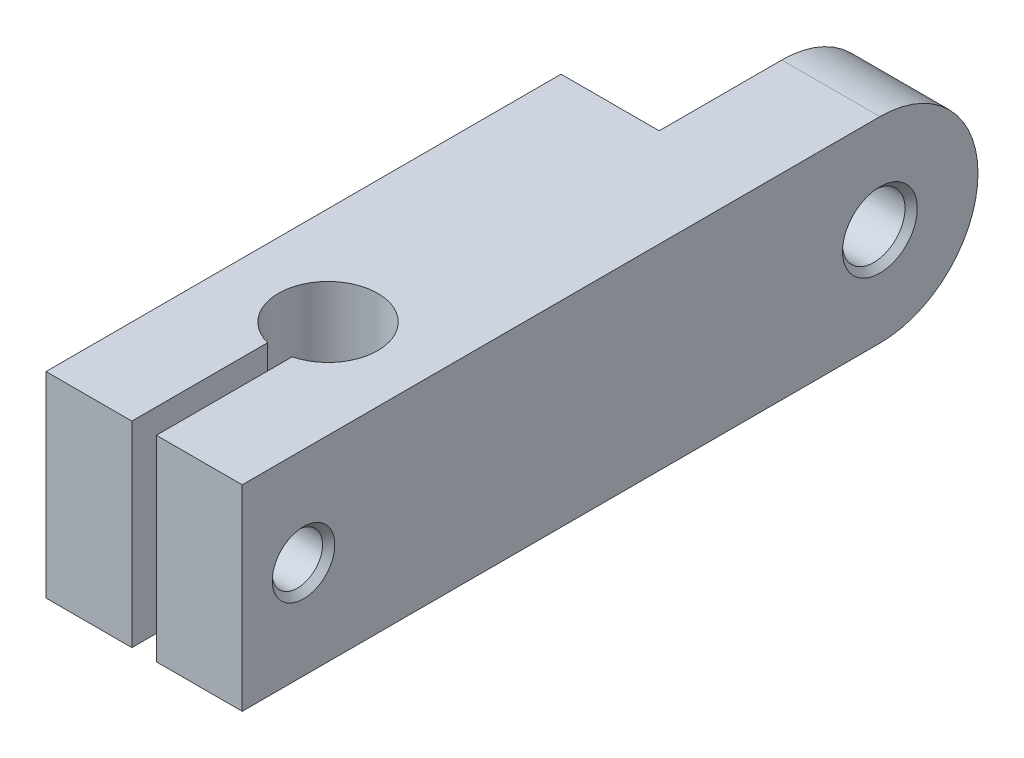
ISO-10303-21;
HEADER;
FILE_DESCRIPTION(('STEP AP214'),'2;1');
FILE_NAME('part.step','',(''),(''),'','','');
FILE_SCHEMA(('AUTOMOTIVE_DESIGN { 1 0 10303 214 1 1 1 1 }'));
ENDSEC;
DATA;
#1=APPLICATION_CONTEXT('core data for automotive mechanical design processes');
#2=APPLICATION_PROTOCOL_DEFINITION('international standard','automotive_design',2000,#1);
#3=PRODUCT_CONTEXT('',#1,'mechanical');
#4=PRODUCT('Part','Part','',(#3));
#5=PRODUCT_RELATED_PRODUCT_CATEGORY('part','',(#4));
#6=PRODUCT_DEFINITION_FORMATION('','',#4);
#7=PRODUCT_DEFINITION_CONTEXT('part definition',#1,'design');
#8=PRODUCT_DEFINITION('design','',#6,#7);
#9=PRODUCT_DEFINITION_SHAPE('','',#8);
#10=(LENGTH_UNIT() NAMED_UNIT(*) SI_UNIT(.MILLI.,.METRE.));
#11=(NAMED_UNIT(*) PLANE_ANGLE_UNIT() SI_UNIT($,.RADIAN.));
#12=(NAMED_UNIT(*) SI_UNIT($,.STERADIAN.) SOLID_ANGLE_UNIT());
#13=UNCERTAINTY_MEASURE_WITH_UNIT(LENGTH_MEASURE(1.E-05),#10,'distance_accuracy_value','');
#14=(GEOMETRIC_REPRESENTATION_CONTEXT(3) GLOBAL_UNCERTAINTY_ASSIGNED_CONTEXT((#13)) GLOBAL_UNIT_ASSIGNED_CONTEXT((#10,
#11,#12)) REPRESENTATION_CONTEXT('',''));
#15=CARTESIAN_POINT('',(0.,0.,0.));
#16=DIRECTION('',(0.,0.,1.));
#17=DIRECTION('',(1.,0.,0.));
#18=AXIS2_PLACEMENT_3D('',#15,#16,#17);
#19=CARTESIAN_POINT('',(8.,8.,60.));
#20=DIRECTION('',(0.,-1.,0.));
#21=DIRECTION('',(1.,0.,0.));
#22=AXIS2_PLACEMENT_3D('',#19,#20,#21);
#23=PLANE('',#22);
#24=DIRECTION('',(-1.,0.,0.));
#25=VECTOR('',#24,1.);
#26=CARTESIAN_POINT('',(8.,8.,8.));
#27=LINE('',#26,#25);
#28=CARTESIAN_POINT('',(8.,8.,8.));
#29=VERTEX_POINT('',#28);
#30=CARTESIAN_POINT('',(0.,8.,8.));
#31=VERTEX_POINT('',#30);
#32=EDGE_CURVE('E123',#29,#31,#27,.T.);
#33=ORIENTED_EDGE('',*,*,#32,.T.);
#34=DIRECTION('',(0.,0.,-1.));
#35=VECTOR('',#34,1.);
#36=CARTESIAN_POINT('',(0.,8.,0.));
#37=LINE('',#36,#35);
#38=CARTESIAN_POINT('',(0.,8.,18.));
#39=VERTEX_POINT('',#38);
#40=EDGE_CURVE('E266',#39,#31,#37,.T.);
#41=ORIENTED_EDGE('',*,*,#40,.F.);
#42=DIRECTION('',(1.,0.,0.));
#43=VECTOR('',#42,1.);
#44=CARTESIAN_POINT('',(-8.,8.,18.));
#45=LINE('',#44,#43);
#46=CARTESIAN_POINT('',(-8.,8.,18.));
#47=VERTEX_POINT('',#46);
#48=EDGE_CURVE('E264',#47,#39,#45,.T.);
#49=ORIENTED_EDGE('',*,*,#48,.F.);
#50=DIRECTION('',(0.,0.,-1.));
#51=VECTOR('',#50,1.);
#52=CARTESIAN_POINT('',(-8.,8.,60.));
#53=LINE('',#52,#51);
#54=CARTESIAN_POINT('',(-8.,8.,60.));
#55=VERTEX_POINT('',#54);
#56=EDGE_CURVE('E147',#55,#47,#53,.T.);
#57=ORIENTED_EDGE('',*,*,#56,.F.);
#58=DIRECTION('',(-1.,0.,0.));
#59=VECTOR('',#58,1.);
#60=CARTESIAN_POINT('',(8.,8.,60.));
#61=LINE('',#60,#59);
#62=CARTESIAN_POINT('',(-0.999999999999996,8.,60.));
#63=VERTEX_POINT('',#62);
#64=EDGE_CURVE('E61',#63,#55,#61,.T.);
#65=ORIENTED_EDGE('',*,*,#64,.F.);
#66=DIRECTION('',(0.,0.,-1.));
#67=VECTOR('',#66,1.);
#68=CARTESIAN_POINT('',(-1.00000000000001,8.,0.));
#69=LINE('',#68,#67);
#70=CARTESIAN_POINT('',(-0.999999999999996,8.,48.9246018906381));
#71=VERTEX_POINT('',#70);
#72=EDGE_CURVE('E54',#63,#71,#69,.T.);
#73=ORIENTED_EDGE('',*,*,#72,.T.);
#74=CARTESIAN_POINT('',(0.,8.,45.));
#75=DIRECTION('',(0.,1.,0.));
#76=DIRECTION('',(-1.,0.,0.));
#77=AXIS2_PLACEMENT_3D('',#74,#75,#76);
#78=CIRCLE('',#77,4.05);
#79=CARTESIAN_POINT('',(1.00000000000001,8.,48.9246018906381));
#80=VERTEX_POINT('',#79);
#81=EDGE_CURVE('E217',#80,#71,#78,.T.);
#82=ORIENTED_EDGE('',*,*,#81,.F.);
#83=DIRECTION('',(0.,0.,-1.));
#84=VECTOR('',#83,1.);
#85=CARTESIAN_POINT('',(1.00000000000001,8.,0.));
#86=LINE('',#85,#84);
#87=CARTESIAN_POINT('',(1.00000000000001,8.,60.));
#88=VERTEX_POINT('',#87);
#89=EDGE_CURVE('E231',#88,#80,#86,.T.);
#90=ORIENTED_EDGE('',*,*,#89,.F.);
#91=CARTESIAN_POINT('',(8.,8.,60.));
#92=VERTEX_POINT('',#91);
#93=EDGE_CURVE('E254',#92,#88,#61,.T.);
#94=ORIENTED_EDGE('',*,*,#93,.F.);
#95=DIRECTION('',(0.,0.,-1.));
#96=VECTOR('',#95,1.);
#97=CARTESIAN_POINT('',(8.,8.,60.));
#98=LINE('',#97,#96);
#99=EDGE_CURVE('E142',#92,#29,#98,.T.);
#100=ORIENTED_EDGE('',*,*,#99,.T.);
#101=EDGE_LOOP('',(#33,#41,#49,#57,#65,#73,#82,#90,#94,#100));
#102=FACE_BOUND('',#101,.T.);
#103=ADVANCED_FACE('F38',(#102),#23,.F.);
#104=CARTESIAN_POINT('',(0.,0.,60.));
#105=DIRECTION('',(0.,0.,1.));
#106=DIRECTION('',(1.,0.,0.));
#107=AXIS2_PLACEMENT_3D('',#104,#105,#106);
#108=PLANE('',#107);
#109=DIRECTION('',(1.,0.,0.));
#110=VECTOR('',#109,1.);
#111=CARTESIAN_POINT('',(8.,-8.,60.));
#112=LINE('',#111,#110);
#113=CARTESIAN_POINT('',(-8.,-8.,60.));
#114=VERTEX_POINT('',#113);
#115=CARTESIAN_POINT('',(-0.999999999999993,-8.,60.));
#116=VERTEX_POINT('',#115);
#117=EDGE_CURVE('E250',#114,#116,#112,.T.);
#118=ORIENTED_EDGE('',*,*,#117,.T.);
#119=DIRECTION('',(0.,1.,0.));
#120=VECTOR('',#119,1.);
#121=CARTESIAN_POINT('',(-0.999999999999993,-8.,60.));
#122=LINE('',#121,#120);
#123=EDGE_CURVE('E245',#116,#63,#122,.T.);
#124=ORIENTED_EDGE('',*,*,#123,.T.);
#125=ORIENTED_EDGE('',*,*,#64,.T.);
#126=DIRECTION('',(0.,-1.,0.));
#127=VECTOR('',#126,1.);
#128=CARTESIAN_POINT('',(-8.,-8.,60.));
#129=LINE('',#128,#127);
#130=EDGE_CURVE('E242',#55,#114,#129,.T.);
#131=ORIENTED_EDGE('',*,*,#130,.T.);
#132=EDGE_LOOP('',(#118,#124,#125,#131));
#133=FACE_BOUND('',#132,.T.);
#134=ADVANCED_FACE('F173',(#133),#108,.T.);
#135=CARTESIAN_POINT('',(-8.,-8.,60.));
#136=DIRECTION('',(1.,0.,0.));
#137=DIRECTION('',(0.,0.,-1.));
#138=AXIS2_PLACEMENT_3D('',#135,#136,#137);
#139=PLANE('',#138);
#140=CARTESIAN_POINT('',(-8.,0.,55.));
#141=DIRECTION('',(-1.,0.,0.));
#142=DIRECTION('',(0.,0.,1.));
#143=AXIS2_PLACEMENT_3D('',#140,#141,#142);
#144=CIRCLE('',#143,1.64999999999999);
#145=CARTESIAN_POINT('',(-8.,0.,56.65));
#146=VERTEX_POINT('',#145);
#147=EDGE_CURVE('E223',#146,#146,#144,.T.);
#148=ORIENTED_EDGE('',*,*,#147,.F.);
#149=EDGE_LOOP('',(#148));
#150=FACE_BOUND('',#149,.T.);
#151=ORIENTED_EDGE('',*,*,#56,.T.);
#152=DIRECTION('',(0.,-1.,0.));
#153=VECTOR('',#152,1.);
#154=CARTESIAN_POINT('',(-8.,0.,18.));
#155=LINE('',#154,#153);
#156=CARTESIAN_POINT('',(-8.,-8.,18.));
#157=VERTEX_POINT('',#156);
#158=EDGE_CURVE('E261',#47,#157,#155,.T.);
#159=ORIENTED_EDGE('',*,*,#158,.T.);
#160=DIRECTION('',(0.,0.,-1.));
#161=VECTOR('',#160,1.);
#162=CARTESIAN_POINT('',(-8.,-8.,60.));
#163=LINE('',#162,#161);
#164=EDGE_CURVE('E141',#114,#157,#163,.T.);
#165=ORIENTED_EDGE('',*,*,#164,.F.);
#166=ORIENTED_EDGE('',*,*,#130,.F.);
#167=EDGE_LOOP('',(#151,#159,#165,#166));
#168=FACE_BOUND('',#167,.T.);
#169=ADVANCED_FACE('F179',(#150,#168),#139,.F.);
#170=CARTESIAN_POINT('',(8.,-8.,60.));
#171=DIRECTION('',(0.,1.,0.));
#172=DIRECTION('',(-1.,0.,0.));
#173=AXIS2_PLACEMENT_3D('',#170,#171,#172);
#174=PLANE('',#173);
#175=DIRECTION('',(0.,0.,-1.));
#176=VECTOR('',#175,1.);
#177=CARTESIAN_POINT('',(0.,-8.,0.));
#178=LINE('',#177,#176);
#179=CARTESIAN_POINT('',(0.,-8.,18.));
#180=VERTEX_POINT('',#179);
#181=CARTESIAN_POINT('',(0.,-8.,8.));
#182=VERTEX_POINT('',#181);
#183=EDGE_CURVE('E137',#180,#182,#178,.T.);
#184=ORIENTED_EDGE('',*,*,#183,.T.);
#185=DIRECTION('',(-1.,0.,0.));
#186=VECTOR('',#185,1.);
#187=CARTESIAN_POINT('',(8.,-8.,8.));
#188=LINE('',#187,#186);
#189=CARTESIAN_POINT('',(8.,-8.,8.));
#190=VERTEX_POINT('',#189);
#191=EDGE_CURVE('E120',#190,#182,#188,.T.);
#192=ORIENTED_EDGE('',*,*,#191,.F.);
#193=DIRECTION('',(0.,0.,-1.));
#194=VECTOR('',#193,1.);
#195=CARTESIAN_POINT('',(8.,-8.,60.));
#196=LINE('',#195,#194);
#197=CARTESIAN_POINT('',(8.,-8.,60.));
#198=VERTEX_POINT('',#197);
#199=EDGE_CURVE('E134',#198,#190,#196,.T.);
#200=ORIENTED_EDGE('',*,*,#199,.F.);
#201=CARTESIAN_POINT('',(1.00000000000001,-8.,60.));
#202=VERTEX_POINT('',#201);
#203=EDGE_CURVE('E249',#202,#198,#112,.T.);
#204=ORIENTED_EDGE('',*,*,#203,.F.);
#205=DIRECTION('',(0.,0.,-1.));
#206=VECTOR('',#205,1.);
#207=CARTESIAN_POINT('',(1.00000000000001,-8.,0.));
#208=LINE('',#207,#206);
#209=CARTESIAN_POINT('',(1.00000000000001,-8.,48.9246018906381));
#210=VERTEX_POINT('',#209);
#211=EDGE_CURVE('E233',#202,#210,#208,.T.);
#212=ORIENTED_EDGE('',*,*,#211,.T.);
#213=CARTESIAN_POINT('',(0.,-8.,45.));
#214=DIRECTION('',(0.,1.,0.));
#215=DIRECTION('',(-1.,0.,0.));
#216=AXIS2_PLACEMENT_3D('',#213,#214,#215);
#217=CIRCLE('',#216,4.05);
#218=CARTESIAN_POINT('',(-0.999999999999994,-8.,48.9246018906381));
#219=VERTEX_POINT('',#218);
#220=EDGE_CURVE('E227',#210,#219,#217,.T.);
#221=ORIENTED_EDGE('',*,*,#220,.T.);
#222=DIRECTION('',(0.,0.,-1.));
#223=VECTOR('',#222,1.);
#224=CARTESIAN_POINT('',(-1.00000000000001,-8.,0.));
#225=LINE('',#224,#223);
#226=EDGE_CURVE('E230',#116,#219,#225,.T.);
#227=ORIENTED_EDGE('',*,*,#226,.F.);
#228=ORIENTED_EDGE('',*,*,#117,.F.);
#229=ORIENTED_EDGE('',*,*,#164,.T.);
#230=DIRECTION('',(1.,0.,0.));
#231=VECTOR('',#230,1.);
#232=CARTESIAN_POINT('',(-8.,-8.,18.));
#233=LINE('',#232,#231);
#234=EDGE_CURVE('E270',#157,#180,#233,.T.);
#235=ORIENTED_EDGE('',*,*,#234,.T.);
#236=EDGE_LOOP('',(#184,#192,#200,#204,#212,#221,#227,#228,#229,#235));
#237=FACE_BOUND('',#236,.T.);
#238=ADVANCED_FACE('F132',(#237),#174,.F.);
#239=CARTESIAN_POINT('',(8.,-8.,60.));
#240=DIRECTION('',(-1.,0.,0.));
#241=DIRECTION('',(0.,0.,1.));
#242=AXIS2_PLACEMENT_3D('',#239,#240,#241);
#243=PLANE('',#242);
#244=CARTESIAN_POINT('',(8.,0.,8.));
#245=DIRECTION('',(-1.,0.,0.));
#246=DIRECTION('',(0.,0.,1.));
#247=AXIS2_PLACEMENT_3D('',#244,#245,#246);
#248=CIRCLE('',#247,3.05);
#249=CARTESIAN_POINT('',(8.,0.,11.05));
#250=VERTEX_POINT('',#249);
#251=EDGE_CURVE('E11',#250,#250,#248,.T.);
#252=ORIENTED_EDGE('',*,*,#251,.T.);
#253=EDGE_LOOP('',(#252));
#254=FACE_BOUND('',#253,.T.);
#255=CARTESIAN_POINT('',(8.,0.,55.));
#256=DIRECTION('',(-1.,0.,0.));
#257=DIRECTION('',(0.,0.,1.));
#258=AXIS2_PLACEMENT_3D('',#255,#256,#257);
#259=CIRCLE('',#258,2.55000000000002);
#260=CARTESIAN_POINT('',(8.,0.,57.55));
#261=VERTEX_POINT('',#260);
#262=EDGE_CURVE('E153',#261,#261,#259,.T.);
#263=ORIENTED_EDGE('',*,*,#262,.T.);
#264=EDGE_LOOP('',(#263));
#265=FACE_BOUND('',#264,.T.);
#266=ORIENTED_EDGE('',*,*,#199,.T.);
#267=CARTESIAN_POINT('',(8.,0.,8.));
#268=DIRECTION('',(1.,0.,0.));
#269=DIRECTION('',(0.,0.,-1.));
#270=AXIS2_PLACEMENT_3D('',#267,#268,#269);
#271=CIRCLE('',#270,8.);
#272=EDGE_CURVE('E117',#190,#29,#271,.T.);
#273=ORIENTED_EDGE('',*,*,#272,.T.);
#274=ORIENTED_EDGE('',*,*,#99,.F.);
#275=DIRECTION('',(0.,1.,0.));
#276=VECTOR('',#275,1.);
#277=CARTESIAN_POINT('',(8.,-8.,60.));
#278=LINE('',#277,#276);
#279=EDGE_CURVE('E140',#198,#92,#278,.T.);
#280=ORIENTED_EDGE('',*,*,#279,.F.);
#281=EDGE_LOOP('',(#266,#273,#274,#280));
#282=FACE_BOUND('',#281,.T.);
#283=ADVANCED_FACE('F139',(#254,#265,#282),#243,.F.);
#284=DIRECTION('',(0.,1.,0.));
#285=VECTOR('',#284,1.);
#286=CARTESIAN_POINT('',(1.00000000000001,-8.,60.));
#287=LINE('',#286,#285);
#288=EDGE_CURVE('E243',#202,#88,#287,.T.);
#289=ORIENTED_EDGE('',*,*,#288,.F.);
#290=ORIENTED_EDGE('',*,*,#203,.T.);
#291=ORIENTED_EDGE('',*,*,#279,.T.);
#292=ORIENTED_EDGE('',*,*,#93,.T.);
#293=EDGE_LOOP('',(#289,#290,#291,#292));
#294=FACE_BOUND('',#293,.T.);
#295=ADVANCED_FACE('F181',(#294),#108,.T.);
#296=CARTESIAN_POINT('',(0.,-8.,45.));
#297=DIRECTION('',(0.,1.,0.));
#298=DIRECTION('',(-1.,0.,0.));
#299=AXIS2_PLACEMENT_3D('',#296,#297,#298);
#300=CYLINDRICAL_SURFACE('',#299,4.05);
#301=ORIENTED_EDGE('',*,*,#81,.T.);
#302=DIRECTION('',(0.,1.,0.));
#303=VECTOR('',#302,1.);
#304=CARTESIAN_POINT('',(-0.999999999999994,-8.,48.9246018906381));
#305=LINE('',#304,#303);
#306=EDGE_CURVE('E235',#219,#71,#305,.T.);
#307=ORIENTED_EDGE('',*,*,#306,.F.);
#308=ORIENTED_EDGE('',*,*,#220,.F.);
#309=DIRECTION('',(0.,1.,0.));
#310=VECTOR('',#309,1.);
#311=CARTESIAN_POINT('',(1.00000000000001,-8.,48.9246018906381));
#312=LINE('',#311,#310);
#313=EDGE_CURVE('E240',#210,#80,#312,.T.);
#314=ORIENTED_EDGE('',*,*,#313,.T.);
#315=EDGE_LOOP('',(#301,#307,#308,#314));
#316=FACE_BOUND('',#315,.T.);
#317=ADVANCED_FACE('F289',(#316),#300,.F.);
#318=CARTESIAN_POINT('',(1.00000000000001,-8.,0.));
#319=DIRECTION('',(1.,0.,0.));
#320=DIRECTION('',(0.,1.,0.));
#321=AXIS2_PLACEMENT_3D('',#318,#319,#320);
#322=PLANE('',#321);
#323=CARTESIAN_POINT('',(1.00000000000001,0.,55.));
#324=DIRECTION('',(1.,0.,0.));
#325=DIRECTION('',(0.,1.,0.));
#326=AXIS2_PLACEMENT_3D('',#323,#324,#325);
#327=CIRCLE('',#326,2.05);
#328=CARTESIAN_POINT('',(1.00000000000001,2.05,55.));
#329=VERTEX_POINT('',#328);
#330=EDGE_CURVE('E215',#329,#329,#327,.F.);
#331=ORIENTED_EDGE('',*,*,#330,.F.);
#332=EDGE_LOOP('',(#331));
#333=FACE_BOUND('',#332,.T.);
#334=ORIENTED_EDGE('',*,*,#89,.T.);
#335=ORIENTED_EDGE('',*,*,#313,.F.);
#336=ORIENTED_EDGE('',*,*,#211,.F.);
#337=ORIENTED_EDGE('',*,*,#288,.T.);
#338=EDGE_LOOP('',(#334,#335,#336,#337));
#339=FACE_BOUND('',#338,.T.);
#340=ADVANCED_FACE('F293',(#333,#339),#322,.F.);
#341=CARTESIAN_POINT('',(-1.00000000000001,-8.,0.));
#342=DIRECTION('',(1.,0.,0.));
#343=DIRECTION('',(0.,0.,-1.));
#344=AXIS2_PLACEMENT_3D('',#341,#342,#343);
#345=PLANE('',#344);
#346=CARTESIAN_POINT('',(-0.999999999999994,0.,55.));
#347=DIRECTION('',(1.,0.,0.));
#348=DIRECTION('',(0.,0.,-1.));
#349=AXIS2_PLACEMENT_3D('',#346,#347,#348);
#350=CIRCLE('',#349,1.64999999999999);
#351=CARTESIAN_POINT('',(-0.999999999999994,0.,53.35));
#352=VERTEX_POINT('',#351);
#353=EDGE_CURVE('E218',#352,#352,#350,.T.);
#354=ORIENTED_EDGE('',*,*,#353,.F.);
#355=EDGE_LOOP('',(#354));
#356=FACE_BOUND('',#355,.T.);
#357=ORIENTED_EDGE('',*,*,#72,.F.);
#358=ORIENTED_EDGE('',*,*,#123,.F.);
#359=ORIENTED_EDGE('',*,*,#226,.T.);
#360=ORIENTED_EDGE('',*,*,#306,.T.);
#361=EDGE_LOOP('',(#357,#358,#359,#360));
#362=FACE_BOUND('',#361,.T.);
#363=ADVANCED_FACE('F206',(#356,#362),#345,.T.);
#364=CARTESIAN_POINT('',(-8.001,0.,55.));
#365=DIRECTION('',(1.,0.,0.));
#366=DIRECTION('',(0.,0.,-1.));
#367=AXIS2_PLACEMENT_3D('',#364,#365,#366);
#368=CYLINDRICAL_SURFACE('',#367,2.05);
#369=CARTESIAN_POINT('',(7.49999999999998,0.,55.));
#370=DIRECTION('',(-1.,0.,0.));
#371=DIRECTION('',(0.,0.,1.));
#372=AXIS2_PLACEMENT_3D('',#369,#370,#371);
#373=CIRCLE('',#372,2.05);
#374=CARTESIAN_POINT('',(7.49999999999998,0.,57.05));
#375=VERTEX_POINT('',#374);
#376=EDGE_CURVE('E145',#375,#375,#373,.F.);
#377=ORIENTED_EDGE('',*,*,#376,.T.);
#378=EDGE_LOOP('',(#377));
#379=FACE_BOUND('',#378,.T.);
#380=ORIENTED_EDGE('',*,*,#330,.T.);
#381=EDGE_LOOP('',(#380));
#382=FACE_BOUND('',#381,.T.);
#383=ADVANCED_FACE('F197',(#379,#382),#368,.F.);
#384=CARTESIAN_POINT('',(7.49999999999998,0.,55.));
#385=DIRECTION('',(1.,0.,0.));
#386=DIRECTION('',(0.,0.,-1.));
#387=AXIS2_PLACEMENT_3D('',#384,#385,#386);
#388=CONICAL_SURFACE('',#387,2.05,0.785398163397447);
#389=ORIENTED_EDGE('',*,*,#262,.F.);
#390=EDGE_LOOP('',(#389));
#391=FACE_BOUND('',#390,.T.);
#392=ORIENTED_EDGE('',*,*,#376,.F.);
#393=EDGE_LOOP('',(#392));
#394=FACE_BOUND('',#393,.T.);
#395=ADVANCED_FACE('F192',(#391,#394),#388,.F.);
#396=CARTESIAN_POINT('',(-8.,0.,55.));
#397=DIRECTION('',(-1.,0.,0.));
#398=DIRECTION('',(0.,0.,1.));
#399=AXIS2_PLACEMENT_3D('',#396,#397,#398);
#400=CYLINDRICAL_SURFACE('',#399,1.64999999999999);
#401=ORIENTED_EDGE('',*,*,#353,.T.);
#402=EDGE_LOOP('',(#401));
#403=FACE_BOUND('',#402,.T.);
#404=ORIENTED_EDGE('',*,*,#147,.T.);
#405=EDGE_LOOP('',(#404));
#406=FACE_BOUND('',#405,.T.);
#407=ADVANCED_FACE('F196',(#403,#406),#400,.F.);
#408=CARTESIAN_POINT('',(0.,0.,0.));
#409=DIRECTION('',(1.,0.,0.));
#410=DIRECTION('',(0.,0.,-1.));
#411=AXIS2_PLACEMENT_3D('',#408,#409,#410);
#412=PLANE('',#411);
#413=CARTESIAN_POINT('',(0.,0.,8.));
#414=DIRECTION('',(1.,0.,0.));
#415=DIRECTION('',(0.,0.,-1.));
#416=AXIS2_PLACEMENT_3D('',#413,#414,#415);
#417=CIRCLE('',#416,2.55);
#418=CARTESIAN_POINT('',(0.,0.,5.45));
#419=VERTEX_POINT('',#418);
#420=EDGE_CURVE('E128',#419,#419,#417,.T.);
#421=ORIENTED_EDGE('',*,*,#420,.T.);
#422=EDGE_LOOP('',(#421));
#423=FACE_BOUND('',#422,.T.);
#424=CARTESIAN_POINT('',(0.,0.,8.));
#425=DIRECTION('',(1.,0.,0.));
#426=DIRECTION('',(0.,0.,-1.));
#427=AXIS2_PLACEMENT_3D('',#424,#425,#426);
#428=CIRCLE('',#427,8.);
#429=EDGE_CURVE('E156',#31,#182,#428,.F.);
#430=ORIENTED_EDGE('',*,*,#429,.T.);
#431=ORIENTED_EDGE('',*,*,#183,.F.);
#432=DIRECTION('',(0.,-1.,0.));
#433=VECTOR('',#432,1.);
#434=CARTESIAN_POINT('',(0.,0.,18.));
#435=LINE('',#434,#433);
#436=EDGE_CURVE('E273',#39,#180,#435,.T.);
#437=ORIENTED_EDGE('',*,*,#436,.F.);
#438=ORIENTED_EDGE('',*,*,#40,.T.);
#439=EDGE_LOOP('',(#430,#431,#437,#438));
#440=FACE_BOUND('',#439,.T.);
#441=ADVANCED_FACE('F203',(#423,#440),#412,.F.);
#442=CARTESIAN_POINT('',(-8.,0.,18.));
#443=DIRECTION('',(0.,0.,1.));
#444=DIRECTION('',(0.,-1.,0.));
#445=AXIS2_PLACEMENT_3D('',#442,#443,#444);
#446=PLANE('',#445);
#447=ORIENTED_EDGE('',*,*,#436,.T.);
#448=ORIENTED_EDGE('',*,*,#234,.F.);
#449=ORIENTED_EDGE('',*,*,#158,.F.);
#450=ORIENTED_EDGE('',*,*,#48,.T.);
#451=EDGE_LOOP('',(#447,#448,#449,#450));
#452=FACE_BOUND('',#451,.T.);
#453=ADVANCED_FACE('F284',(#452),#446,.F.);
#454=CARTESIAN_POINT('',(8.,0.,8.));
#455=DIRECTION('',(-1.,0.,0.));
#456=DIRECTION('',(0.,0.,1.));
#457=AXIS2_PLACEMENT_3D('',#454,#455,#456);
#458=CYLINDRICAL_SURFACE('',#457,8.);
#459=ORIENTED_EDGE('',*,*,#429,.F.);
#460=ORIENTED_EDGE('',*,*,#32,.F.);
#461=ORIENTED_EDGE('',*,*,#272,.F.);
#462=ORIENTED_EDGE('',*,*,#191,.T.);
#463=EDGE_LOOP('',(#459,#460,#461,#462));
#464=FACE_BOUND('',#463,.T.);
#465=ADVANCED_FACE('F119',(#464),#458,.T.);
#466=CARTESIAN_POINT('',(-8.,0.,8.));
#467=DIRECTION('',(1.,0.,0.));
#468=DIRECTION('',(0.,0.,-1.));
#469=AXIS2_PLACEMENT_3D('',#466,#467,#468);
#470=CYLINDRICAL_SURFACE('',#469,2.55);
#471=CARTESIAN_POINT('',(7.5,0.,8.));
#472=DIRECTION('',(-1.,0.,0.));
#473=DIRECTION('',(0.,0.,1.));
#474=AXIS2_PLACEMENT_3D('',#471,#472,#473);
#475=CIRCLE('',#474,2.55);
#476=CARTESIAN_POINT('',(7.5,0.,10.55));
#477=VERTEX_POINT('',#476);
#478=EDGE_CURVE('E47',#477,#477,#475,.F.);
#479=ORIENTED_EDGE('',*,*,#478,.T.);
#480=EDGE_LOOP('',(#479));
#481=FACE_BOUND('',#480,.T.);
#482=ORIENTED_EDGE('',*,*,#420,.F.);
#483=EDGE_LOOP('',(#482));
#484=FACE_BOUND('',#483,.T.);
#485=ADVANCED_FACE('F162',(#481,#484),#470,.F.);
#486=CARTESIAN_POINT('',(7.5,0.,8.));
#487=DIRECTION('',(1.,0.,0.));
#488=DIRECTION('',(0.,0.,-1.));
#489=AXIS2_PLACEMENT_3D('',#486,#487,#488);
#490=CONICAL_SURFACE('',#489,2.55,0.785398163397446);
#491=ORIENTED_EDGE('',*,*,#251,.F.);
#492=EDGE_LOOP('',(#491));
#493=FACE_BOUND('',#492,.T.);
#494=ORIENTED_EDGE('',*,*,#478,.F.);
#495=EDGE_LOOP('',(#494));
#496=FACE_BOUND('',#495,.T.);
#497=ADVANCED_FACE('F41',(#493,#496),#490,.F.);
#498=CLOSED_SHELL('',(#103,#134,#169,#238,#283,#295,#317,#340,#363,#383,#395,#407,#441,#453,
#465,#485,#497));
#499=MANIFOLD_SOLID_BREP('B2',#498);
#500=ADVANCED_BREP_SHAPE_REPRESENTATION('',(#18,#499),#14);
#501=SHAPE_DEFINITION_REPRESENTATION(#9,#500);
ENDSEC;
END-ISO-10303-21;
